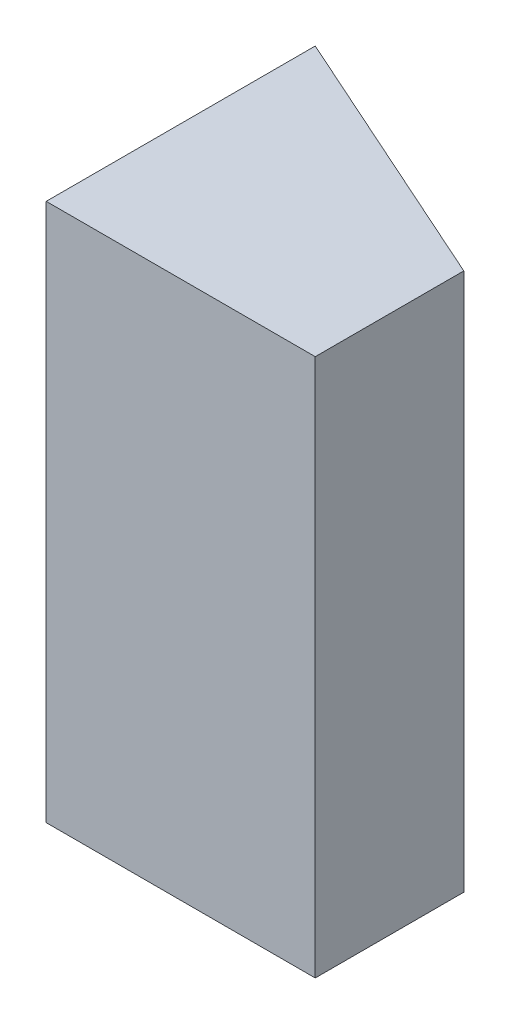
ISO-10303-21;
HEADER;
FILE_DESCRIPTION(('STEP AP214'),'2;1');
FILE_NAME('part.step','',(''),(''),'','','');
FILE_SCHEMA(('AUTOMOTIVE_DESIGN { 1 0 10303 214 1 1 1 1 }'));
ENDSEC;
DATA;
#1=APPLICATION_CONTEXT('core data for automotive mechanical design processes');
#2=APPLICATION_PROTOCOL_DEFINITION('international standard','automotive_design',2000,#1);
#3=PRODUCT_CONTEXT('',#1,'mechanical');
#4=PRODUCT('Part','Part','',(#3));
#5=PRODUCT_RELATED_PRODUCT_CATEGORY('part','',(#4));
#6=PRODUCT_DEFINITION_FORMATION('','',#4);
#7=PRODUCT_DEFINITION_CONTEXT('part definition',#1,'design');
#8=PRODUCT_DEFINITION('design','',#6,#7);
#9=PRODUCT_DEFINITION_SHAPE('','',#8);
#10=(LENGTH_UNIT() NAMED_UNIT(*) SI_UNIT(.MILLI.,.METRE.));
#11=(NAMED_UNIT(*) PLANE_ANGLE_UNIT() SI_UNIT($,.RADIAN.));
#12=(NAMED_UNIT(*) SI_UNIT($,.STERADIAN.) SOLID_ANGLE_UNIT());
#13=UNCERTAINTY_MEASURE_WITH_UNIT(LENGTH_MEASURE(1.E-05),#10,'distance_accuracy_value','');
#14=(GEOMETRIC_REPRESENTATION_CONTEXT(3) GLOBAL_UNCERTAINTY_ASSIGNED_CONTEXT((#13)) GLOBAL_UNIT_ASSIGNED_CONTEXT((#10,
#11,#12)) REPRESENTATION_CONTEXT('',''));
#15=CARTESIAN_POINT('',(0.,0.,0.));
#16=DIRECTION('',(0.,0.,1.));
#17=DIRECTION('',(1.,0.,0.));
#18=AXIS2_PLACEMENT_3D('',#15,#16,#17);
#19=CARTESIAN_POINT('',(-51.374196062884,-10.01,-7.60192675795078));
#20=DIRECTION('',(-0.408711157303925,0.,0.912663787982894));
#21=DIRECTION('',(0.912663787982894,0.,0.408711157303925));
#22=AXIS2_PLACEMENT_3D('',#19,#20,#21);
#23=PLANE('',#22);
#24=DIRECTION('',(0.,1.,0.));
#25=VECTOR('',#24,1.);
#26=CARTESIAN_POINT('',(-51.374196062884,-10.,-7.60192675795078));
#27=LINE('',#26,#25);
#28=CARTESIAN_POINT('',(-51.374196062884,-10.,-7.60192675795078));
#29=VERTEX_POINT('',#28);
#30=CARTESIAN_POINT('',(-51.374196062884,10.,-7.60192675795078));
#31=VERTEX_POINT('',#30);
#32=EDGE_CURVE('E11',#29,#31,#27,.T.);
#33=ORIENTED_EDGE('',*,*,#32,.T.);
#34=DIRECTION('',(0.912663787982894,0.,0.408711157303925));
#35=VECTOR('',#34,1.);
#36=CARTESIAN_POINT('',(-5.74615347938707,10.,12.8313262486464));
#37=LINE('',#36,#35);
#38=CARTESIAN_POINT('',(-41.374196062884,10.,-3.12370418918611));
#39=VERTEX_POINT('',#38);
#40=EDGE_CURVE('E53',#31,#39,#37,.T.);
#41=ORIENTED_EDGE('',*,*,#40,.T.);
#42=DIRECTION('',(0.,1.,0.));
#43=VECTOR('',#42,1.);
#44=CARTESIAN_POINT('',(-41.374196062884,-10.,-3.12370418918611));
#45=LINE('',#44,#43);
#46=CARTESIAN_POINT('',(-41.374196062884,-10.,-3.12370418918611));
#47=VERTEX_POINT('',#46);
#48=EDGE_CURVE('E120',#47,#39,#45,.T.);
#49=ORIENTED_EDGE('',*,*,#48,.F.);
#50=DIRECTION('',(0.912663787982894,0.,0.408711157303925));
#51=VECTOR('',#50,1.);
#52=CARTESIAN_POINT('',(-5.74615347938707,-10.,12.8313262486464));
#53=LINE('',#52,#51);
#54=EDGE_CURVE('E47',#29,#47,#53,.T.);
#55=ORIENTED_EDGE('',*,*,#54,.F.);
#56=EDGE_LOOP('',(#33,#41,#49,#55));
#57=FACE_BOUND('',#56,.T.);
#58=ADVANCED_FACE('F44',(#57),#23,.F.);
#59=CARTESIAN_POINT('',(-51.374196062884,-10.,0.));
#60=DIRECTION('',(-1.,0.,0.));
#61=DIRECTION('',(0.,0.,1.));
#62=AXIS2_PLACEMENT_3D('',#59,#60,#61);
#63=PLANE('',#62);
#64=DIRECTION('',(0.,1.,0.));
#65=VECTOR('',#64,1.);
#66=CARTESIAN_POINT('',(-51.374196062884,-10.,2.39807324204921));
#67=LINE('',#66,#65);
#68=CARTESIAN_POINT('',(-51.374196062884,-10.,2.39807324204921));
#69=VERTEX_POINT('',#68);
#70=CARTESIAN_POINT('',(-51.374196062884,10.,2.39807324204921));
#71=VERTEX_POINT('',#70);
#72=EDGE_CURVE('E86',#69,#71,#67,.T.);
#73=ORIENTED_EDGE('',*,*,#72,.T.);
#74=DIRECTION('',(0.,0.,1.));
#75=VECTOR('',#74,1.);
#76=CARTESIAN_POINT('',(-51.374196062884,10.,0.));
#77=LINE('',#76,#75);
#78=EDGE_CURVE('E89',#31,#71,#77,.T.);
#79=ORIENTED_EDGE('',*,*,#78,.F.);
#80=ORIENTED_EDGE('',*,*,#32,.F.);
#81=DIRECTION('',(0.,0.,1.));
#82=VECTOR('',#81,1.);
#83=CARTESIAN_POINT('',(-51.374196062884,-10.,0.));
#84=LINE('',#83,#82);
#85=EDGE_CURVE('E91',#29,#69,#84,.T.);
#86=ORIENTED_EDGE('',*,*,#85,.T.);
#87=EDGE_LOOP('',(#73,#79,#80,#86));
#88=FACE_BOUND('',#87,.T.);
#89=ADVANCED_FACE('F88',(#88),#63,.T.);
#90=CARTESIAN_POINT('',(-41.374196062884,-10.,0.));
#91=DIRECTION('',(-1.,0.,0.));
#92=DIRECTION('',(0.,0.,1.));
#93=AXIS2_PLACEMENT_3D('',#90,#91,#92);
#94=PLANE('',#93);
#95=ORIENTED_EDGE('',*,*,#48,.T.);
#96=DIRECTION('',(0.,0.,1.));
#97=VECTOR('',#96,1.);
#98=CARTESIAN_POINT('',(-41.374196062884,10.,0.));
#99=LINE('',#98,#97);
#100=CARTESIAN_POINT('',(-41.374196062884,10.,2.39807324204921));
#101=VERTEX_POINT('',#100);
#102=EDGE_CURVE('E105',#39,#101,#99,.T.);
#103=ORIENTED_EDGE('',*,*,#102,.T.);
#104=DIRECTION('',(0.,1.,0.));
#105=VECTOR('',#104,1.);
#106=CARTESIAN_POINT('',(-41.374196062884,-10.,2.39807324204921));
#107=LINE('',#106,#105);
#108=CARTESIAN_POINT('',(-41.374196062884,-10.,2.39807324204921));
#109=VERTEX_POINT('',#108);
#110=EDGE_CURVE('E96',#109,#101,#107,.T.);
#111=ORIENTED_EDGE('',*,*,#110,.F.);
#112=DIRECTION('',(0.,0.,1.));
#113=VECTOR('',#112,1.);
#114=CARTESIAN_POINT('',(-41.374196062884,-10.,0.));
#115=LINE('',#114,#113);
#116=EDGE_CURVE('E97',#47,#109,#115,.T.);
#117=ORIENTED_EDGE('',*,*,#116,.F.);
#118=EDGE_LOOP('',(#95,#103,#111,#117));
#119=FACE_BOUND('',#118,.T.);
#120=ADVANCED_FACE('F130',(#119),#94,.F.);
#121=CARTESIAN_POINT('',(0.,-10.,2.39807324204921));
#122=DIRECTION('',(0.,0.,1.));
#123=DIRECTION('',(1.,0.,0.));
#124=AXIS2_PLACEMENT_3D('',#121,#122,#123);
#125=PLANE('',#124);
#126=ORIENTED_EDGE('',*,*,#110,.T.);
#127=DIRECTION('',(1.,0.,0.));
#128=VECTOR('',#127,1.);
#129=CARTESIAN_POINT('',(0.,10.,2.39807324204921));
#130=LINE('',#129,#128);
#131=EDGE_CURVE('E100',#71,#101,#130,.T.);
#132=ORIENTED_EDGE('',*,*,#131,.F.);
#133=ORIENTED_EDGE('',*,*,#72,.F.);
#134=DIRECTION('',(1.,0.,0.));
#135=VECTOR('',#134,1.);
#136=CARTESIAN_POINT('',(0.,-10.,2.39807324204921));
#137=LINE('',#136,#135);
#138=EDGE_CURVE('E115',#69,#109,#137,.T.);
#139=ORIENTED_EDGE('',*,*,#138,.T.);
#140=EDGE_LOOP('',(#126,#132,#133,#139));
#141=FACE_BOUND('',#140,.T.);
#142=ADVANCED_FACE('F101',(#141),#125,.T.);
#143=CARTESIAN_POINT('',(0.,-10.,0.));
#144=DIRECTION('',(0.,1.,0.));
#145=DIRECTION('',(0.,0.,1.));
#146=AXIS2_PLACEMENT_3D('',#143,#144,#145);
#147=PLANE('',#146);
#148=ORIENTED_EDGE('',*,*,#85,.F.);
#149=ORIENTED_EDGE('',*,*,#54,.T.);
#150=ORIENTED_EDGE('',*,*,#116,.T.);
#151=ORIENTED_EDGE('',*,*,#138,.F.);
#152=EDGE_LOOP('',(#148,#149,#150,#151));
#153=FACE_BOUND('',#152,.T.);
#154=ADVANCED_FACE('F127',(#153),#147,.F.);
#155=CARTESIAN_POINT('',(0.,10.,0.));
#156=DIRECTION('',(0.,1.,0.));
#157=DIRECTION('',(0.,0.,1.));
#158=AXIS2_PLACEMENT_3D('',#155,#156,#157);
#159=PLANE('',#158);
#160=ORIENTED_EDGE('',*,*,#40,.F.);
#161=ORIENTED_EDGE('',*,*,#78,.T.);
#162=ORIENTED_EDGE('',*,*,#131,.T.);
#163=ORIENTED_EDGE('',*,*,#102,.F.);
#164=EDGE_LOOP('',(#160,#161,#162,#163));
#165=FACE_BOUND('',#164,.T.);
#166=ADVANCED_FACE('F107',(#165),#159,.T.);
#167=CLOSED_SHELL('',(#58,#89,#120,#142,#154,#166));
#168=MANIFOLD_SOLID_BREP('B2',#167);
#169=ADVANCED_BREP_SHAPE_REPRESENTATION('',(#18,#168),#14);
#170=SHAPE_DEFINITION_REPRESENTATION(#9,#169);
ENDSEC;
END-ISO-10303-21;
